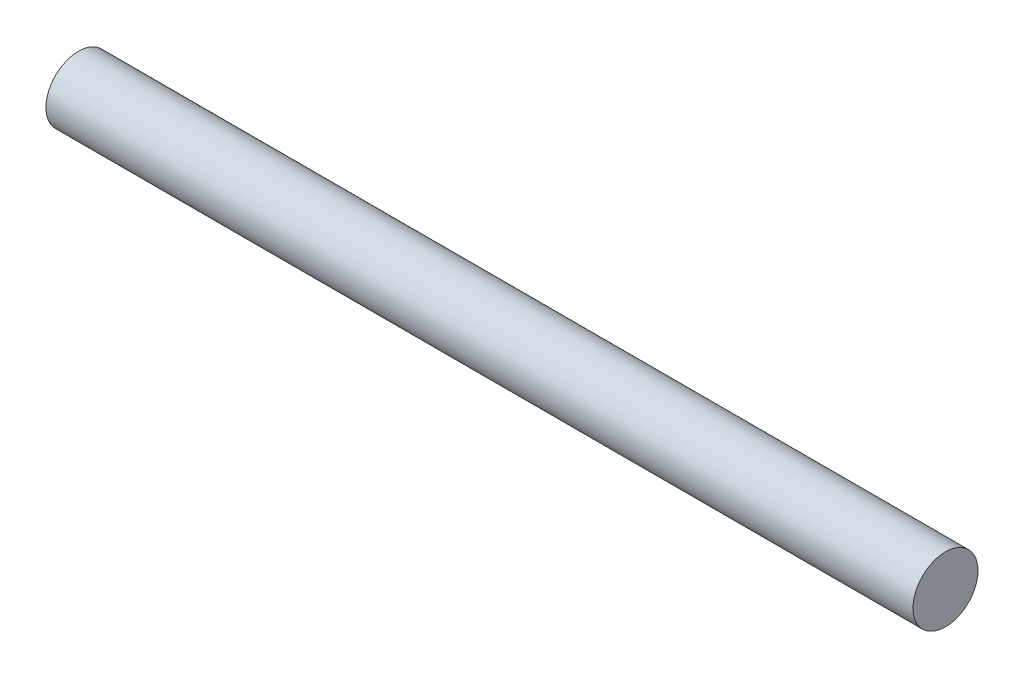
ISO-10303-21;
HEADER;
FILE_DESCRIPTION(('STEP AP214'),'2;1');
FILE_NAME('part.step','',(''),(''),'','','');
FILE_SCHEMA(('AUTOMOTIVE_DESIGN { 1 0 10303 214 1 1 1 1 }'));
ENDSEC;
DATA;
#1=APPLICATION_CONTEXT('core data for automotive mechanical design processes');
#2=APPLICATION_PROTOCOL_DEFINITION('international standard','automotive_design',2000,#1);
#3=PRODUCT_CONTEXT('',#1,'mechanical');
#4=PRODUCT('Part','Part','',(#3));
#5=PRODUCT_RELATED_PRODUCT_CATEGORY('part','',(#4));
#6=PRODUCT_DEFINITION_FORMATION('','',#4);
#7=PRODUCT_DEFINITION_CONTEXT('part definition',#1,'design');
#8=PRODUCT_DEFINITION('design','',#6,#7);
#9=PRODUCT_DEFINITION_SHAPE('','',#8);
#10=(LENGTH_UNIT() NAMED_UNIT(*) SI_UNIT(.MILLI.,.METRE.));
#11=(NAMED_UNIT(*) PLANE_ANGLE_UNIT() SI_UNIT($,.RADIAN.));
#12=(NAMED_UNIT(*) SI_UNIT($,.STERADIAN.) SOLID_ANGLE_UNIT());
#13=UNCERTAINTY_MEASURE_WITH_UNIT(LENGTH_MEASURE(1.E-05),#10,'distance_accuracy_value','');
#14=(GEOMETRIC_REPRESENTATION_CONTEXT(3) GLOBAL_UNCERTAINTY_ASSIGNED_CONTEXT((#13)) GLOBAL_UNIT_ASSIGNED_CONTEXT((#10,
#11,#12)) REPRESENTATION_CONTEXT('',''));
#15=CARTESIAN_POINT('',(0.,0.,0.));
#16=DIRECTION('',(0.,0.,1.));
#17=DIRECTION('',(1.,0.,0.));
#18=AXIS2_PLACEMENT_3D('',#15,#16,#17);
#19=CARTESIAN_POINT('',(40.,0.,0.));
#20=DIRECTION('',(-1.,0.,0.));
#21=DIRECTION('',(0.,0.,1.));
#22=AXIS2_PLACEMENT_3D('',#19,#20,#21);
#23=CYLINDRICAL_SURFACE('',#22,1.5);
#24=CARTESIAN_POINT('',(40.,0.,0.));
#25=DIRECTION('',(1.,0.,0.));
#26=DIRECTION('',(0.,0.,-1.));
#27=AXIS2_PLACEMENT_3D('',#24,#25,#26);
#28=CIRCLE('',#27,1.5);
#29=CARTESIAN_POINT('',(40.,0.,-1.5));
#30=VERTEX_POINT('',#29);
#31=EDGE_CURVE('E10',#30,#30,#28,.T.);
#32=ORIENTED_EDGE('',*,*,#31,.F.);
#33=EDGE_LOOP('',(#32));
#34=FACE_BOUND('',#33,.T.);
#35=CARTESIAN_POINT('',(0.,0.,0.));
#36=DIRECTION('',(1.,0.,0.));
#37=DIRECTION('',(0.,0.,-1.));
#38=AXIS2_PLACEMENT_3D('',#35,#36,#37);
#39=CIRCLE('',#38,1.5);
#40=CARTESIAN_POINT('',(0.,0.,-1.5));
#41=VERTEX_POINT('',#40);
#42=EDGE_CURVE('E33',#41,#41,#39,.T.);
#43=ORIENTED_EDGE('',*,*,#42,.T.);
#44=EDGE_LOOP('',(#43));
#45=FACE_BOUND('',#44,.T.);
#46=ADVANCED_FACE('F30',(#34,#45),#23,.T.);
#47=CARTESIAN_POINT('',(40.,0.,0.));
#48=DIRECTION('',(1.,0.,0.));
#49=DIRECTION('',(0.,0.,-1.));
#50=AXIS2_PLACEMENT_3D('',#47,#48,#49);
#51=PLANE('',#50);
#52=ORIENTED_EDGE('',*,*,#31,.T.);
#53=EDGE_LOOP('',(#52));
#54=FACE_BOUND('',#53,.T.);
#55=ADVANCED_FACE('F45',(#54),#51,.T.);
#56=CARTESIAN_POINT('',(0.,0.,0.));
#57=DIRECTION('',(1.,0.,0.));
#58=DIRECTION('',(0.,0.,-1.));
#59=AXIS2_PLACEMENT_3D('',#56,#57,#58);
#60=PLANE('',#59);
#61=ORIENTED_EDGE('',*,*,#42,.F.);
#62=EDGE_LOOP('',(#61));
#63=FACE_BOUND('',#62,.T.);
#64=ADVANCED_FACE('F43',(#63),#60,.F.);
#65=CLOSED_SHELL('',(#46,#55,#64));
#66=MANIFOLD_SOLID_BREP('B2',#65);
#67=ADVANCED_BREP_SHAPE_REPRESENTATION('',(#18,#66),#14);
#68=SHAPE_DEFINITION_REPRESENTATION(#9,#67);
ENDSEC;
END-ISO-10303-21;
